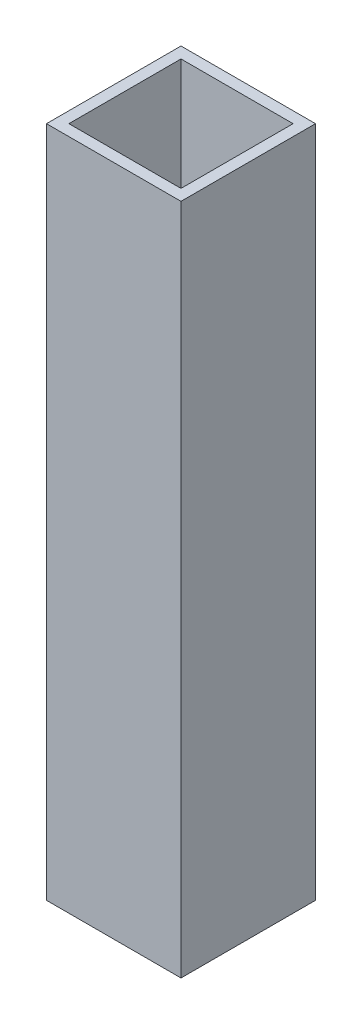
ISO-10303-21;
HEADER;
FILE_DESCRIPTION(('STEP AP214'),'2;1');
FILE_NAME('part.step','',(''),(''),'','','');
FILE_SCHEMA(('AUTOMOTIVE_DESIGN { 1 0 10303 214 1 1 1 1 }'));
ENDSEC;
DATA;
#1=APPLICATION_CONTEXT('core data for automotive mechanical design processes');
#2=APPLICATION_PROTOCOL_DEFINITION('international standard','automotive_design',2000,#1);
#3=PRODUCT_CONTEXT('',#1,'mechanical');
#4=PRODUCT('Part','Part','',(#3));
#5=PRODUCT_RELATED_PRODUCT_CATEGORY('part','',(#4));
#6=PRODUCT_DEFINITION_FORMATION('','',#4);
#7=PRODUCT_DEFINITION_CONTEXT('part definition',#1,'design');
#8=PRODUCT_DEFINITION('design','',#6,#7);
#9=PRODUCT_DEFINITION_SHAPE('','',#8);
#10=(LENGTH_UNIT() NAMED_UNIT(*) SI_UNIT(.MILLI.,.METRE.));
#11=(NAMED_UNIT(*) PLANE_ANGLE_UNIT() SI_UNIT($,.RADIAN.));
#12=(NAMED_UNIT(*) SI_UNIT($,.STERADIAN.) SOLID_ANGLE_UNIT());
#13=UNCERTAINTY_MEASURE_WITH_UNIT(LENGTH_MEASURE(1.E-05),#10,'distance_accuracy_value','');
#14=(GEOMETRIC_REPRESENTATION_CONTEXT(3) GLOBAL_UNCERTAINTY_ASSIGNED_CONTEXT((#13)) GLOBAL_UNIT_ASSIGNED_CONTEXT((#10,
#11,#12)) REPRESENTATION_CONTEXT('',''));
#15=CARTESIAN_POINT('',(0.,0.,0.));
#16=DIRECTION('',(0.,0.,1.));
#17=DIRECTION('',(1.,0.,0.));
#18=AXIS2_PLACEMENT_3D('',#15,#16,#17);
#19=CARTESIAN_POINT('',(0.,190.5,0.));
#20=DIRECTION('',(0.,-1.,0.));
#21=DIRECTION('',(0.,0.,-1.));
#22=AXIS2_PLACEMENT_3D('',#19,#20,#21);
#23=PLANE('',#22);
#24=DIRECTION('',(0.,0.,1.));
#25=VECTOR('',#24,1.);
#26=CARTESIAN_POINT('',(0.,190.5,0.));
#27=LINE('',#26,#25);
#28=CARTESIAN_POINT('',(0.,190.5,-38.1));
#29=VERTEX_POINT('',#28);
#30=CARTESIAN_POINT('',(0.,190.5,0.));
#31=VERTEX_POINT('',#30);
#32=EDGE_CURVE('E133',#29,#31,#27,.T.);
#33=ORIENTED_EDGE('',*,*,#32,.T.);
#34=DIRECTION('',(1.,0.,0.));
#35=VECTOR('',#34,1.);
#36=CARTESIAN_POINT('',(0.,190.5,0.));
#37=LINE('',#36,#35);
#38=CARTESIAN_POINT('',(38.1,190.5,0.));
#39=VERTEX_POINT('',#38);
#40=EDGE_CURVE('E136',#31,#39,#37,.T.);
#41=ORIENTED_EDGE('',*,*,#40,.T.);
#42=DIRECTION('',(0.,0.,-1.));
#43=VECTOR('',#42,1.);
#44=CARTESIAN_POINT('',(38.1,190.5,0.));
#45=LINE('',#44,#43);
#46=CARTESIAN_POINT('',(38.1,190.5,-38.1));
#47=VERTEX_POINT('',#46);
#48=EDGE_CURVE('E139',#39,#47,#45,.T.);
#49=ORIENTED_EDGE('',*,*,#48,.T.);
#50=DIRECTION('',(-1.,0.,0.));
#51=VECTOR('',#50,1.);
#52=CARTESIAN_POINT('',(0.,190.5,-38.1));
#53=LINE('',#52,#51);
#54=EDGE_CURVE('E141',#47,#29,#53,.T.);
#55=ORIENTED_EDGE('',*,*,#54,.T.);
#56=EDGE_LOOP('',(#33,#41,#49,#55));
#57=FACE_BOUND('',#56,.T.);
#58=DIRECTION('',(0.,0.,1.));
#59=VECTOR('',#58,1.);
#60=CARTESIAN_POINT('',(3.17499999999998,190.5,-3.17500000000004));
#61=LINE('',#60,#59);
#62=CARTESIAN_POINT('',(3.17499999999998,190.5,-34.925));
#63=VERTEX_POINT('',#62);
#64=CARTESIAN_POINT('',(3.17499999999998,190.5,-3.17500000000004));
#65=VERTEX_POINT('',#64);
#66=EDGE_CURVE('E97',#63,#65,#61,.T.);
#67=ORIENTED_EDGE('',*,*,#66,.F.);
#68=DIRECTION('',(-1.,0.,0.));
#69=VECTOR('',#68,1.);
#70=CARTESIAN_POINT('',(3.17499999999998,190.5,-34.925));
#71=LINE('',#70,#69);
#72=CARTESIAN_POINT('',(34.925,190.5,-34.925));
#73=VERTEX_POINT('',#72);
#74=EDGE_CURVE('E119',#73,#63,#71,.T.);
#75=ORIENTED_EDGE('',*,*,#74,.F.);
#76=DIRECTION('',(0.,0.,-1.));
#77=VECTOR('',#76,1.);
#78=CARTESIAN_POINT('',(34.925,190.5,-3.17500000000004));
#79=LINE('',#78,#77);
#80=CARTESIAN_POINT('',(34.925,190.5,-3.17500000000004));
#81=VERTEX_POINT('',#80);
#82=EDGE_CURVE('E117',#81,#73,#79,.T.);
#83=ORIENTED_EDGE('',*,*,#82,.F.);
#84=DIRECTION('',(1.,0.,0.));
#85=VECTOR('',#84,1.);
#86=CARTESIAN_POINT('',(3.17499999999998,190.5,-3.17500000000004));
#87=LINE('',#86,#85);
#88=EDGE_CURVE('E105',#65,#81,#87,.T.);
#89=ORIENTED_EDGE('',*,*,#88,.F.);
#90=EDGE_LOOP('',(#67,#75,#83,#89));
#91=FACE_BOUND('',#90,.T.);
#92=ADVANCED_FACE('F32',(#57,#91),#23,.F.);
#93=CARTESIAN_POINT('',(0.,0.,0.));
#94=DIRECTION('',(0.,-1.,0.));
#95=DIRECTION('',(0.,0.,-1.));
#96=AXIS2_PLACEMENT_3D('',#93,#94,#95);
#97=PLANE('',#96);
#98=DIRECTION('',(0.,0.,1.));
#99=VECTOR('',#98,1.);
#100=CARTESIAN_POINT('',(0.,0.,0.));
#101=LINE('',#100,#99);
#102=CARTESIAN_POINT('',(0.,0.,-38.1));
#103=VERTEX_POINT('',#102);
#104=CARTESIAN_POINT('',(0.,0.,0.));
#105=VERTEX_POINT('',#104);
#106=EDGE_CURVE('E113',#103,#105,#101,.T.);
#107=ORIENTED_EDGE('',*,*,#106,.F.);
#108=DIRECTION('',(-1.,0.,0.));
#109=VECTOR('',#108,1.);
#110=CARTESIAN_POINT('',(0.,0.,-38.1));
#111=LINE('',#110,#109);
#112=CARTESIAN_POINT('',(38.1,0.,-38.1));
#113=VERTEX_POINT('',#112);
#114=EDGE_CURVE('E137',#113,#103,#111,.T.);
#115=ORIENTED_EDGE('',*,*,#114,.F.);
#116=DIRECTION('',(0.,0.,-1.));
#117=VECTOR('',#116,1.);
#118=CARTESIAN_POINT('',(38.1,0.,0.));
#119=LINE('',#118,#117);
#120=CARTESIAN_POINT('',(38.1,0.,0.));
#121=VERTEX_POINT('',#120);
#122=EDGE_CURVE('E148',#121,#113,#119,.T.);
#123=ORIENTED_EDGE('',*,*,#122,.F.);
#124=DIRECTION('',(1.,0.,0.));
#125=VECTOR('',#124,1.);
#126=CARTESIAN_POINT('',(0.,0.,0.));
#127=LINE('',#126,#125);
#128=EDGE_CURVE('E146',#105,#121,#127,.T.);
#129=ORIENTED_EDGE('',*,*,#128,.F.);
#130=EDGE_LOOP('',(#107,#115,#123,#129));
#131=FACE_BOUND('',#130,.T.);
#132=DIRECTION('',(-1.,0.,0.));
#133=VECTOR('',#132,1.);
#134=CARTESIAN_POINT('',(3.17499999999998,0.,-34.925));
#135=LINE('',#134,#133);
#136=CARTESIAN_POINT('',(34.925,0.,-34.925));
#137=VERTEX_POINT('',#136);
#138=CARTESIAN_POINT('',(3.17499999999998,0.,-34.925));
#139=VERTEX_POINT('',#138);
#140=EDGE_CURVE('E106',#137,#139,#135,.T.);
#141=ORIENTED_EDGE('',*,*,#140,.T.);
#142=DIRECTION('',(0.,0.,1.));
#143=VECTOR('',#142,1.);
#144=CARTESIAN_POINT('',(3.17499999999998,0.,-3.17500000000004));
#145=LINE('',#144,#143);
#146=CARTESIAN_POINT('',(3.17499999999998,0.,-3.17500000000004));
#147=VERTEX_POINT('',#146);
#148=EDGE_CURVE('E55',#139,#147,#145,.T.);
#149=ORIENTED_EDGE('',*,*,#148,.T.);
#150=DIRECTION('',(1.,0.,0.));
#151=VECTOR('',#150,1.);
#152=CARTESIAN_POINT('',(3.17499999999998,0.,-3.17500000000004));
#153=LINE('',#152,#151);
#154=CARTESIAN_POINT('',(34.925,0.,-3.17500000000004));
#155=VERTEX_POINT('',#154);
#156=EDGE_CURVE('E112',#147,#155,#153,.T.);
#157=ORIENTED_EDGE('',*,*,#156,.T.);
#158=DIRECTION('',(0.,0.,-1.));
#159=VECTOR('',#158,1.);
#160=CARTESIAN_POINT('',(34.925,0.,-3.17500000000004));
#161=LINE('',#160,#159);
#162=EDGE_CURVE('E125',#155,#137,#161,.T.);
#163=ORIENTED_EDGE('',*,*,#162,.T.);
#164=EDGE_LOOP('',(#141,#149,#157,#163));
#165=FACE_BOUND('',#164,.T.);
#166=ADVANCED_FACE('F166',(#131,#165),#97,.T.);
#167=CARTESIAN_POINT('',(0.,190.5,0.));
#168=DIRECTION('',(1.,0.,0.));
#169=DIRECTION('',(0.,0.,-1.));
#170=AXIS2_PLACEMENT_3D('',#167,#168,#169);
#171=PLANE('',#170);
#172=ORIENTED_EDGE('',*,*,#106,.T.);
#173=DIRECTION('',(0.,-1.,0.));
#174=VECTOR('',#173,1.);
#175=CARTESIAN_POINT('',(0.,190.5,0.));
#176=LINE('',#175,#174);
#177=EDGE_CURVE('E11',#31,#105,#176,.T.);
#178=ORIENTED_EDGE('',*,*,#177,.F.);
#179=ORIENTED_EDGE('',*,*,#32,.F.);
#180=DIRECTION('',(0.,-1.,0.));
#181=VECTOR('',#180,1.);
#182=CARTESIAN_POINT('',(0.,190.5,-38.1));
#183=LINE('',#182,#181);
#184=EDGE_CURVE('E143',#29,#103,#183,.T.);
#185=ORIENTED_EDGE('',*,*,#184,.T.);
#186=EDGE_LOOP('',(#172,#178,#179,#185));
#187=FACE_BOUND('',#186,.T.);
#188=ADVANCED_FACE('F34',(#187),#171,.F.);
#189=CARTESIAN_POINT('',(0.,190.5,0.));
#190=DIRECTION('',(0.,0.,-1.));
#191=DIRECTION('',(-1.,0.,0.));
#192=AXIS2_PLACEMENT_3D('',#189,#190,#191);
#193=PLANE('',#192);
#194=ORIENTED_EDGE('',*,*,#128,.T.);
#195=DIRECTION('',(0.,-1.,0.));
#196=VECTOR('',#195,1.);
#197=CARTESIAN_POINT('',(38.1,190.5,0.));
#198=LINE('',#197,#196);
#199=EDGE_CURVE('E40',#39,#121,#198,.T.);
#200=ORIENTED_EDGE('',*,*,#199,.F.);
#201=ORIENTED_EDGE('',*,*,#40,.F.);
#202=ORIENTED_EDGE('',*,*,#177,.T.);
#203=EDGE_LOOP('',(#194,#200,#201,#202));
#204=FACE_BOUND('',#203,.T.);
#205=ADVANCED_FACE('F176',(#204),#193,.F.);
#206=CARTESIAN_POINT('',(38.1,190.5,0.));
#207=DIRECTION('',(-1.,0.,0.));
#208=DIRECTION('',(0.,0.,1.));
#209=AXIS2_PLACEMENT_3D('',#206,#207,#208);
#210=PLANE('',#209);
#211=ORIENTED_EDGE('',*,*,#122,.T.);
#212=DIRECTION('',(0.,-1.,0.));
#213=VECTOR('',#212,1.);
#214=CARTESIAN_POINT('',(38.1,190.5,-38.1));
#215=LINE('',#214,#213);
#216=EDGE_CURVE('E153',#47,#113,#215,.T.);
#217=ORIENTED_EDGE('',*,*,#216,.F.);
#218=ORIENTED_EDGE('',*,*,#48,.F.);
#219=ORIENTED_EDGE('',*,*,#199,.T.);
#220=EDGE_LOOP('',(#211,#217,#218,#219));
#221=FACE_BOUND('',#220,.T.);
#222=ADVANCED_FACE('F160',(#221),#210,.F.);
#223=CARTESIAN_POINT('',(0.,190.5,-38.1));
#224=DIRECTION('',(0.,0.,1.));
#225=DIRECTION('',(1.,0.,0.));
#226=AXIS2_PLACEMENT_3D('',#223,#224,#225);
#227=PLANE('',#226);
#228=ORIENTED_EDGE('',*,*,#114,.T.);
#229=ORIENTED_EDGE('',*,*,#184,.F.);
#230=ORIENTED_EDGE('',*,*,#54,.F.);
#231=ORIENTED_EDGE('',*,*,#216,.T.);
#232=EDGE_LOOP('',(#228,#229,#230,#231));
#233=FACE_BOUND('',#232,.T.);
#234=ADVANCED_FACE('F170',(#233),#227,.F.);
#235=CARTESIAN_POINT('',(3.17499999999998,190.5,-3.17500000000004));
#236=DIRECTION('',(1.,0.,0.));
#237=DIRECTION('',(0.,0.,-1.));
#238=AXIS2_PLACEMENT_3D('',#235,#236,#237);
#239=PLANE('',#238);
#240=ORIENTED_EDGE('',*,*,#148,.F.);
#241=DIRECTION('',(0.,-1.,0.));
#242=VECTOR('',#241,1.);
#243=CARTESIAN_POINT('',(3.17499999999998,190.5,-34.925));
#244=LINE('',#243,#242);
#245=EDGE_CURVE('E101',#63,#139,#244,.T.);
#246=ORIENTED_EDGE('',*,*,#245,.F.);
#247=ORIENTED_EDGE('',*,*,#66,.T.);
#248=DIRECTION('',(0.,-1.,0.));
#249=VECTOR('',#248,1.);
#250=CARTESIAN_POINT('',(3.17499999999998,190.5,-3.17500000000004));
#251=LINE('',#250,#249);
#252=EDGE_CURVE('E100',#65,#147,#251,.T.);
#253=ORIENTED_EDGE('',*,*,#252,.T.);
#254=EDGE_LOOP('',(#240,#246,#247,#253));
#255=FACE_BOUND('',#254,.T.);
#256=ADVANCED_FACE('F99',(#255),#239,.T.);
#257=CARTESIAN_POINT('',(3.17499999999998,190.5,-3.17500000000004));
#258=DIRECTION('',(0.,0.,-1.));
#259=DIRECTION('',(-1.,0.,0.));
#260=AXIS2_PLACEMENT_3D('',#257,#258,#259);
#261=PLANE('',#260);
#262=ORIENTED_EDGE('',*,*,#156,.F.);
#263=ORIENTED_EDGE('',*,*,#252,.F.);
#264=ORIENTED_EDGE('',*,*,#88,.T.);
#265=DIRECTION('',(0.,-1.,0.));
#266=VECTOR('',#265,1.);
#267=CARTESIAN_POINT('',(34.925,190.5,-3.17500000000004));
#268=LINE('',#267,#266);
#269=EDGE_CURVE('E114',#81,#155,#268,.T.);
#270=ORIENTED_EDGE('',*,*,#269,.T.);
#271=EDGE_LOOP('',(#262,#263,#264,#270));
#272=FACE_BOUND('',#271,.T.);
#273=ADVANCED_FACE('F109',(#272),#261,.T.);
#274=CARTESIAN_POINT('',(34.925,190.5,-3.17500000000004));
#275=DIRECTION('',(-1.,0.,0.));
#276=DIRECTION('',(0.,0.,1.));
#277=AXIS2_PLACEMENT_3D('',#274,#275,#276);
#278=PLANE('',#277);
#279=ORIENTED_EDGE('',*,*,#162,.F.);
#280=ORIENTED_EDGE('',*,*,#269,.F.);
#281=ORIENTED_EDGE('',*,*,#82,.T.);
#282=DIRECTION('',(0.,-1.,0.));
#283=VECTOR('',#282,1.);
#284=CARTESIAN_POINT('',(34.925,190.5,-34.925));
#285=LINE('',#284,#283);
#286=EDGE_CURVE('E47',#73,#137,#285,.T.);
#287=ORIENTED_EDGE('',*,*,#286,.T.);
#288=EDGE_LOOP('',(#279,#280,#281,#287));
#289=FACE_BOUND('',#288,.T.);
#290=ADVANCED_FACE('F199',(#289),#278,.T.);
#291=CARTESIAN_POINT('',(3.17499999999998,190.5,-34.925));
#292=DIRECTION('',(0.,0.,1.));
#293=DIRECTION('',(1.,0.,0.));
#294=AXIS2_PLACEMENT_3D('',#291,#292,#293);
#295=PLANE('',#294);
#296=ORIENTED_EDGE('',*,*,#140,.F.);
#297=ORIENTED_EDGE('',*,*,#286,.F.);
#298=ORIENTED_EDGE('',*,*,#74,.T.);
#299=ORIENTED_EDGE('',*,*,#245,.T.);
#300=EDGE_LOOP('',(#296,#297,#298,#299));
#301=FACE_BOUND('',#300,.T.);
#302=ADVANCED_FACE('F203',(#301),#295,.T.);
#303=CLOSED_SHELL('',(#92,#166,#188,#205,#222,#234,#256,#273,#290,#302));
#304=MANIFOLD_SOLID_BREP('B2',#303);
#305=ADVANCED_BREP_SHAPE_REPRESENTATION('',(#18,#304),#14);
#306=SHAPE_DEFINITION_REPRESENTATION(#9,#305);
ENDSEC;
END-ISO-10303-21;
